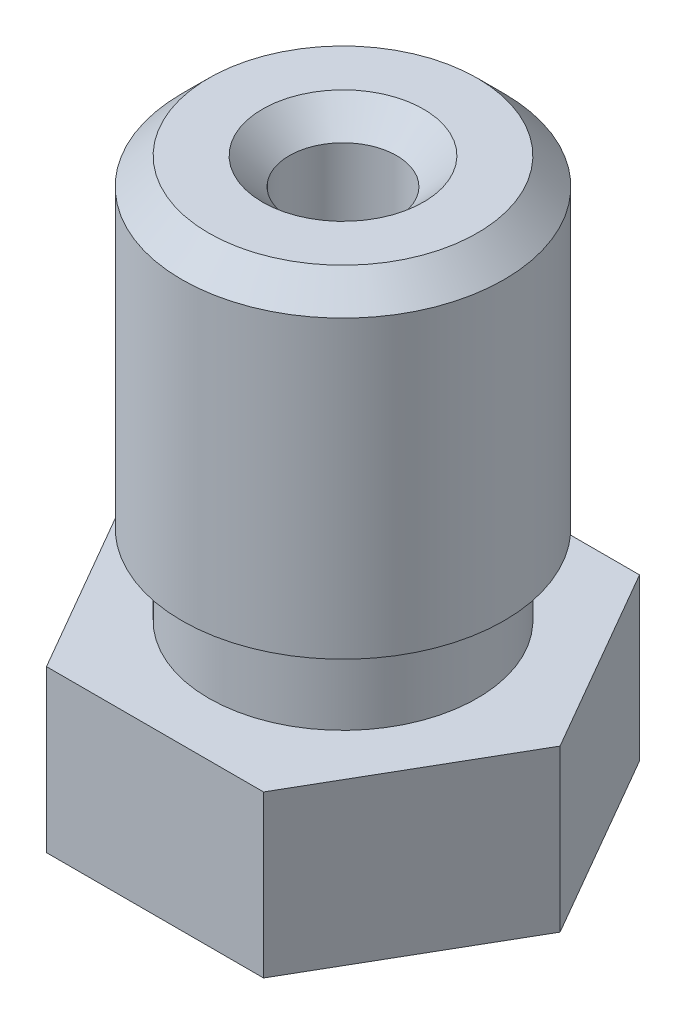
ISO-10303-21;
HEADER;
FILE_DESCRIPTION(('STEP AP214'),'2;1');
FILE_NAME('part.step','',(''),(''),'','','');
FILE_SCHEMA(('AUTOMOTIVE_DESIGN { 1 0 10303 214 1 1 1 1 }'));
ENDSEC;
DATA;
#1=APPLICATION_CONTEXT('core data for automotive mechanical design processes');
#2=APPLICATION_PROTOCOL_DEFINITION('international standard','automotive_design',2000,#1);
#3=PRODUCT_CONTEXT('',#1,'mechanical');
#4=PRODUCT('Part','Part','',(#3));
#5=PRODUCT_RELATED_PRODUCT_CATEGORY('part','',(#4));
#6=PRODUCT_DEFINITION_FORMATION('','',#4);
#7=PRODUCT_DEFINITION_CONTEXT('part definition',#1,'design');
#8=PRODUCT_DEFINITION('design','',#6,#7);
#9=PRODUCT_DEFINITION_SHAPE('','',#8);
#10=(LENGTH_UNIT() NAMED_UNIT(*) SI_UNIT(.MILLI.,.METRE.));
#11=(NAMED_UNIT(*) PLANE_ANGLE_UNIT() SI_UNIT($,.RADIAN.));
#12=(NAMED_UNIT(*) SI_UNIT($,.STERADIAN.) SOLID_ANGLE_UNIT());
#13=UNCERTAINTY_MEASURE_WITH_UNIT(LENGTH_MEASURE(1.E-05),#10,'distance_accuracy_value','');
#14=(GEOMETRIC_REPRESENTATION_CONTEXT(3) GLOBAL_UNCERTAINTY_ASSIGNED_CONTEXT((#13)) GLOBAL_UNIT_ASSIGNED_CONTEXT((#10,
#11,#12)) REPRESENTATION_CONTEXT('',''));
#15=CARTESIAN_POINT('',(0.,0.,0.));
#16=DIRECTION('',(0.,0.,1.));
#17=DIRECTION('',(1.,0.,0.));
#18=AXIS2_PLACEMENT_3D('',#15,#16,#17);
#19=CARTESIAN_POINT('',(2.02072594216369,3.,3.5));
#20=DIRECTION('',(0.,0.,1.));
#21=DIRECTION('',(1.,0.,0.));
#22=AXIS2_PLACEMENT_3D('',#19,#20,#21);
#23=PLANE('',#22);
#24=DIRECTION('',(-1.,0.,0.));
#25=VECTOR('',#24,1.);
#26=CARTESIAN_POINT('',(2.02072594216369,0.,3.5));
#27=LINE('',#26,#25);
#28=CARTESIAN_POINT('',(2.02072594216369,0.,3.5));
#29=VERTEX_POINT('',#28);
#30=CARTESIAN_POINT('',(-2.02072594216369,0.,3.5));
#31=VERTEX_POINT('',#30);
#32=EDGE_CURVE('E121',#29,#31,#27,.T.);
#33=ORIENTED_EDGE('',*,*,#32,.F.);
#34=DIRECTION('',(0.,-1.,0.));
#35=VECTOR('',#34,1.);
#36=CARTESIAN_POINT('',(2.02072594216369,3.,3.5));
#37=LINE('',#36,#35);
#38=CARTESIAN_POINT('',(2.02072594216369,3.,3.5));
#39=VERTEX_POINT('',#38);
#40=EDGE_CURVE('E50',#39,#29,#37,.T.);
#41=ORIENTED_EDGE('',*,*,#40,.F.);
#42=DIRECTION('',(-1.,0.,0.));
#43=VECTOR('',#42,1.);
#44=CARTESIAN_POINT('',(2.02072594216369,3.,3.5));
#45=LINE('',#44,#43);
#46=CARTESIAN_POINT('',(-2.02072594216369,3.,3.5));
#47=VERTEX_POINT('',#46);
#48=EDGE_CURVE('E137',#39,#47,#45,.T.);
#49=ORIENTED_EDGE('',*,*,#48,.T.);
#50=DIRECTION('',(0.,-1.,0.));
#51=VECTOR('',#50,1.);
#52=CARTESIAN_POINT('',(-2.02072594216369,3.,3.5));
#53=LINE('',#52,#51);
#54=EDGE_CURVE('E85',#47,#31,#53,.T.);
#55=ORIENTED_EDGE('',*,*,#54,.T.);
#56=EDGE_LOOP('',(#33,#41,#49,#55));
#57=FACE_BOUND('',#56,.T.);
#58=ADVANCED_FACE('F33',(#57),#23,.T.);
#59=CARTESIAN_POINT('',(4.04145188432738,3.,0.));
#60=DIRECTION('',(0.866025403784439,0.,0.5));
#61=DIRECTION('',(0.5,0.,-0.866025403784439));
#62=AXIS2_PLACEMENT_3D('',#59,#60,#61);
#63=PLANE('',#62);
#64=DIRECTION('',(-0.5,0.,0.866025403784439));
#65=VECTOR('',#64,1.);
#66=CARTESIAN_POINT('',(4.04145188432738,0.,0.));
#67=LINE('',#66,#65);
#68=CARTESIAN_POINT('',(4.04145188432738,0.,0.));
#69=VERTEX_POINT('',#68);
#70=EDGE_CURVE('E134',#69,#29,#67,.T.);
#71=ORIENTED_EDGE('',*,*,#70,.F.);
#72=DIRECTION('',(0.,-1.,0.));
#73=VECTOR('',#72,1.);
#74=CARTESIAN_POINT('',(4.04145188432738,3.,0.));
#75=LINE('',#74,#73);
#76=CARTESIAN_POINT('',(4.04145188432738,3.,0.));
#77=VERTEX_POINT('',#76);
#78=EDGE_CURVE('E73',#77,#69,#75,.T.);
#79=ORIENTED_EDGE('',*,*,#78,.F.);
#80=DIRECTION('',(-0.5,0.,0.866025403784439));
#81=VECTOR('',#80,1.);
#82=CARTESIAN_POINT('',(4.04145188432738,3.,0.));
#83=LINE('',#82,#81);
#84=EDGE_CURVE('E111',#77,#39,#83,.T.);
#85=ORIENTED_EDGE('',*,*,#84,.T.);
#86=ORIENTED_EDGE('',*,*,#40,.T.);
#87=EDGE_LOOP('',(#71,#79,#85,#86));
#88=FACE_BOUND('',#87,.T.);
#89=ADVANCED_FACE('F210',(#88),#63,.T.);
#90=CARTESIAN_POINT('',(2.02072594216369,3.,-3.5));
#91=DIRECTION('',(0.866025403784438,0.,-0.500000000000001));
#92=DIRECTION('',(-0.500000000000001,0.,-0.866025403784438));
#93=AXIS2_PLACEMENT_3D('',#90,#91,#92);
#94=PLANE('',#93);
#95=DIRECTION('',(0.500000000000001,0.,0.866025403784438));
#96=VECTOR('',#95,1.);
#97=CARTESIAN_POINT('',(2.02072594216369,0.,-3.5));
#98=LINE('',#97,#96);
#99=CARTESIAN_POINT('',(2.02072594216369,0.,-3.5));
#100=VERTEX_POINT('',#99);
#101=EDGE_CURVE('E98',#100,#69,#98,.T.);
#102=ORIENTED_EDGE('',*,*,#101,.F.);
#103=DIRECTION('',(0.,-1.,0.));
#104=VECTOR('',#103,1.);
#105=CARTESIAN_POINT('',(2.02072594216369,3.,-3.5));
#106=LINE('',#105,#104);
#107=CARTESIAN_POINT('',(2.02072594216369,3.,-3.5));
#108=VERTEX_POINT('',#107);
#109=EDGE_CURVE('E93',#108,#100,#106,.T.);
#110=ORIENTED_EDGE('',*,*,#109,.F.);
#111=DIRECTION('',(0.500000000000001,0.,0.866025403784438));
#112=VECTOR('',#111,1.);
#113=CARTESIAN_POINT('',(2.02072594216369,3.,-3.5));
#114=LINE('',#113,#112);
#115=EDGE_CURVE('E96',#108,#77,#114,.T.);
#116=ORIENTED_EDGE('',*,*,#115,.T.);
#117=ORIENTED_EDGE('',*,*,#78,.T.);
#118=EDGE_LOOP('',(#102,#110,#116,#117));
#119=FACE_BOUND('',#118,.T.);
#120=ADVANCED_FACE('F95',(#119),#94,.T.);
#121=CARTESIAN_POINT('',(-2.02072594216369,3.,-3.5));
#122=DIRECTION('',(0.,0.,-1.));
#123=DIRECTION('',(-1.,0.,0.));
#124=AXIS2_PLACEMENT_3D('',#121,#122,#123);
#125=PLANE('',#124);
#126=DIRECTION('',(1.,0.,0.));
#127=VECTOR('',#126,1.);
#128=CARTESIAN_POINT('',(-2.02072594216369,0.,-3.5));
#129=LINE('',#128,#127);
#130=CARTESIAN_POINT('',(-2.02072594216369,0.,-3.5));
#131=VERTEX_POINT('',#130);
#132=EDGE_CURVE('E131',#131,#100,#129,.T.);
#133=ORIENTED_EDGE('',*,*,#132,.F.);
#134=DIRECTION('',(0.,-1.,0.));
#135=VECTOR('',#134,1.);
#136=CARTESIAN_POINT('',(-2.02072594216369,3.,-3.5));
#137=LINE('',#136,#135);
#138=CARTESIAN_POINT('',(-2.02072594216369,3.,-3.5));
#139=VERTEX_POINT('',#138);
#140=EDGE_CURVE('E103',#139,#131,#137,.T.);
#141=ORIENTED_EDGE('',*,*,#140,.F.);
#142=DIRECTION('',(1.,0.,0.));
#143=VECTOR('',#142,1.);
#144=CARTESIAN_POINT('',(-2.02072594216369,3.,-3.5));
#145=LINE('',#144,#143);
#146=EDGE_CURVE('E109',#139,#108,#145,.T.);
#147=ORIENTED_EDGE('',*,*,#146,.T.);
#148=ORIENTED_EDGE('',*,*,#109,.T.);
#149=EDGE_LOOP('',(#133,#141,#147,#148));
#150=FACE_BOUND('',#149,.T.);
#151=ADVANCED_FACE('F113',(#150),#125,.T.);
#152=CARTESIAN_POINT('',(-4.04145188432738,3.,0.));
#153=DIRECTION('',(-0.866025403784439,0.,-0.5));
#154=DIRECTION('',(-0.5,0.,0.866025403784439));
#155=AXIS2_PLACEMENT_3D('',#152,#153,#154);
#156=PLANE('',#155);
#157=DIRECTION('',(0.5,0.,-0.866025403784439));
#158=VECTOR('',#157,1.);
#159=CARTESIAN_POINT('',(-4.04145188432738,0.,0.));
#160=LINE('',#159,#158);
#161=CARTESIAN_POINT('',(-4.04145188432738,0.,0.));
#162=VERTEX_POINT('',#161);
#163=EDGE_CURVE('E128',#162,#131,#160,.T.);
#164=ORIENTED_EDGE('',*,*,#163,.F.);
#165=DIRECTION('',(0.,-1.,0.));
#166=VECTOR('',#165,1.);
#167=CARTESIAN_POINT('',(-4.04145188432738,3.,0.));
#168=LINE('',#167,#166);
#169=CARTESIAN_POINT('',(-4.04145188432738,3.,0.));
#170=VERTEX_POINT('',#169);
#171=EDGE_CURVE('E142',#170,#162,#168,.T.);
#172=ORIENTED_EDGE('',*,*,#171,.F.);
#173=DIRECTION('',(0.5,0.,-0.866025403784439));
#174=VECTOR('',#173,1.);
#175=CARTESIAN_POINT('',(-4.04145188432738,3.,0.));
#176=LINE('',#175,#174);
#177=EDGE_CURVE('E114',#170,#139,#176,.T.);
#178=ORIENTED_EDGE('',*,*,#177,.T.);
#179=ORIENTED_EDGE('',*,*,#140,.T.);
#180=EDGE_LOOP('',(#164,#172,#178,#179));
#181=FACE_BOUND('',#180,.T.);
#182=ADVANCED_FACE('F224',(#181),#156,.T.);
#183=CARTESIAN_POINT('',(-2.02072594216369,3.,3.5));
#184=DIRECTION('',(-0.866025403784439,0.,0.5));
#185=DIRECTION('',(0.5,0.,0.866025403784439));
#186=AXIS2_PLACEMENT_3D('',#183,#184,#185);
#187=PLANE('',#186);
#188=DIRECTION('',(-0.5,0.,-0.866025403784439));
#189=VECTOR('',#188,1.);
#190=CARTESIAN_POINT('',(-2.02072594216369,0.,3.5));
#191=LINE('',#190,#189);
#192=EDGE_CURVE('E124',#31,#162,#191,.T.);
#193=ORIENTED_EDGE('',*,*,#192,.F.);
#194=ORIENTED_EDGE('',*,*,#54,.F.);
#195=DIRECTION('',(-0.5,0.,-0.866025403784439));
#196=VECTOR('',#195,1.);
#197=CARTESIAN_POINT('',(-2.02072594216369,3.,3.5));
#198=LINE('',#197,#196);
#199=EDGE_CURVE('E116',#47,#170,#198,.T.);
#200=ORIENTED_EDGE('',*,*,#199,.T.);
#201=ORIENTED_EDGE('',*,*,#171,.T.);
#202=EDGE_LOOP('',(#193,#194,#200,#201));
#203=FACE_BOUND('',#202,.T.);
#204=ADVANCED_FACE('F206',(#203),#187,.T.);
#205=CARTESIAN_POINT('',(0.,3.,0.));
#206=DIRECTION('',(0.,-1.,0.));
#207=DIRECTION('',(0.,0.,-1.));
#208=AXIS2_PLACEMENT_3D('',#205,#206,#207);
#209=PLANE('',#208);
#210=CARTESIAN_POINT('',(0.,3.,0.));
#211=DIRECTION('',(0.,1.,0.));
#212=DIRECTION('',(0.,0.,1.));
#213=AXIS2_PLACEMENT_3D('',#210,#211,#212);
#214=CIRCLE('',#213,2.5);
#215=CARTESIAN_POINT('',(0.,3.,2.5));
#216=VERTEX_POINT('',#215);
#217=EDGE_CURVE('E125',#216,#216,#214,.T.);
#218=ORIENTED_EDGE('',*,*,#217,.F.);
#219=EDGE_LOOP('',(#218));
#220=FACE_BOUND('',#219,.T.);
#221=ORIENTED_EDGE('',*,*,#48,.F.);
#222=ORIENTED_EDGE('',*,*,#84,.F.);
#223=ORIENTED_EDGE('',*,*,#115,.F.);
#224=ORIENTED_EDGE('',*,*,#146,.F.);
#225=ORIENTED_EDGE('',*,*,#177,.F.);
#226=ORIENTED_EDGE('',*,*,#199,.F.);
#227=EDGE_LOOP('',(#221,#222,#223,#224,#225,#226));
#228=FACE_BOUND('',#227,.T.);
#229=ADVANCED_FACE('F107',(#220,#228),#209,.F.);
#230=CARTESIAN_POINT('',(0.,0.,0.));
#231=DIRECTION('',(0.,-1.,0.));
#232=DIRECTION('',(0.,0.,-1.));
#233=AXIS2_PLACEMENT_3D('',#230,#231,#232);
#234=PLANE('',#233);
#235=CARTESIAN_POINT('',(0.,0.,0.));
#236=DIRECTION('',(0.,-1.,0.));
#237=DIRECTION('',(0.,0.,-1.));
#238=AXIS2_PLACEMENT_3D('',#235,#236,#237);
#239=CIRCLE('',#238,2.50000000004502);
#240=CARTESIAN_POINT('',(0.,0.,-2.50000000004502));
#241=VERTEX_POINT('',#240);
#242=EDGE_CURVE('E139',#241,#241,#239,.T.);
#243=ORIENTED_EDGE('',*,*,#242,.F.);
#244=EDGE_LOOP('',(#243));
#245=FACE_BOUND('',#244,.T.);
#246=ORIENTED_EDGE('',*,*,#32,.T.);
#247=ORIENTED_EDGE('',*,*,#192,.T.);
#248=ORIENTED_EDGE('',*,*,#163,.T.);
#249=ORIENTED_EDGE('',*,*,#132,.T.);
#250=ORIENTED_EDGE('',*,*,#101,.T.);
#251=ORIENTED_EDGE('',*,*,#70,.T.);
#252=EDGE_LOOP('',(#246,#247,#248,#249,#250,#251));
#253=FACE_BOUND('',#252,.T.);
#254=ADVANCED_FACE('F209',(#245,#253),#234,.T.);
#255=CARTESIAN_POINT('',(0.,3.,0.));
#256=DIRECTION('',(0.,1.,0.));
#257=DIRECTION('',(0.,0.,1.));
#258=AXIS2_PLACEMENT_3D('',#255,#256,#257);
#259=CYLINDRICAL_SURFACE('',#258,2.5);
#260=ORIENTED_EDGE('',*,*,#217,.T.);
#261=EDGE_LOOP('',(#260));
#262=FACE_BOUND('',#261,.T.);
#263=CARTESIAN_POINT('',(0.,4.5,0.));
#264=DIRECTION('',(0.,1.,0.));
#265=DIRECTION('',(0.,0.,1.));
#266=AXIS2_PLACEMENT_3D('',#263,#264,#265);
#267=CIRCLE('',#266,2.5);
#268=CARTESIAN_POINT('',(0.,4.5,2.5));
#269=VERTEX_POINT('',#268);
#270=EDGE_CURVE('E198',#269,#269,#267,.T.);
#271=ORIENTED_EDGE('',*,*,#270,.F.);
#272=EDGE_LOOP('',(#271));
#273=FACE_BOUND('',#272,.T.);
#274=ADVANCED_FACE('F167',(#262,#273),#259,.T.);
#275=CARTESIAN_POINT('',(0.,10.5,0.));
#276=DIRECTION('',(0.,1.,0.));
#277=DIRECTION('',(0.,0.,1.));
#278=AXIS2_PLACEMENT_3D('',#275,#276,#277);
#279=PLANE('',#278);
#280=CARTESIAN_POINT('',(0.,10.5,0.));
#281=DIRECTION('',(0.,1.,0.));
#282=DIRECTION('',(0.,0.,1.));
#283=AXIS2_PLACEMENT_3D('',#280,#281,#282);
#284=CIRCLE('',#283,2.4999999999834);
#285=CARTESIAN_POINT('',(0.,10.5,2.4999999999834));
#286=VERTEX_POINT('',#285);
#287=EDGE_CURVE('E150',#286,#286,#284,.T.);
#288=ORIENTED_EDGE('',*,*,#287,.T.);
#289=EDGE_LOOP('',(#288));
#290=FACE_BOUND('',#289,.T.);
#291=CARTESIAN_POINT('',(-1.10963134903613E-11,10.5,0.));
#292=DIRECTION('',(0.,1.,0.));
#293=DIRECTION('',(0.,0.,1.));
#294=AXIS2_PLACEMENT_3D('',#291,#292,#293);
#295=CIRCLE('',#294,1.5000000000277);
#296=CARTESIAN_POINT('',(-1.10963134903613E-11,10.5,1.5000000000277));
#297=VERTEX_POINT('',#296);
#298=EDGE_CURVE('E147',#297,#297,#295,.F.);
#299=ORIENTED_EDGE('',*,*,#298,.T.);
#300=EDGE_LOOP('',(#299));
#301=FACE_BOUND('',#300,.T.);
#302=ADVANCED_FACE('F164',(#290,#301),#279,.T.);
#303=CARTESIAN_POINT('',(0.,3.,0.));
#304=DIRECTION('',(0.,1.,0.));
#305=DIRECTION('',(0.,0.,1.));
#306=AXIS2_PLACEMENT_3D('',#303,#304,#305);
#307=CYLINDRICAL_SURFACE('',#306,3.);
#308=CARTESIAN_POINT('',(0.,9.9999999999834,0.));
#309=DIRECTION('',(0.,1.,0.));
#310=DIRECTION('',(0.,0.,1.));
#311=AXIS2_PLACEMENT_3D('',#308,#309,#310);
#312=CIRCLE('',#311,3.);
#313=CARTESIAN_POINT('',(0.,9.9999999999834,3.));
#314=VERTEX_POINT('',#313);
#315=EDGE_CURVE('E42',#314,#314,#312,.F.);
#316=ORIENTED_EDGE('',*,*,#315,.T.);
#317=EDGE_LOOP('',(#316));
#318=FACE_BOUND('',#317,.T.);
#319=CARTESIAN_POINT('',(0.,4.5,0.));
#320=DIRECTION('',(0.,1.,0.));
#321=DIRECTION('',(0.,0.,1.));
#322=AXIS2_PLACEMENT_3D('',#319,#320,#321);
#323=CIRCLE('',#322,3.);
#324=CARTESIAN_POINT('',(0.,4.5,3.));
#325=VERTEX_POINT('',#324);
#326=EDGE_CURVE('E201',#325,#325,#323,.T.);
#327=ORIENTED_EDGE('',*,*,#326,.T.);
#328=EDGE_LOOP('',(#327));
#329=FACE_BOUND('',#328,.T.);
#330=ADVANCED_FACE('F155',(#318,#329),#307,.T.);
#331=CARTESIAN_POINT('',(3.,4.5,0.));
#332=DIRECTION('',(0.,-1.,0.));
#333=DIRECTION('',(0.,0.,-1.));
#334=AXIS2_PLACEMENT_3D('',#331,#332,#333);
#335=PLANE('',#334);
#336=ORIENTED_EDGE('',*,*,#270,.T.);
#337=EDGE_LOOP('',(#336));
#338=FACE_BOUND('',#337,.T.);
#339=ORIENTED_EDGE('',*,*,#326,.F.);
#340=EDGE_LOOP('',(#339));
#341=FACE_BOUND('',#340,.T.);
#342=ADVANCED_FACE('F244',(#338,#341),#335,.T.);
#343=CARTESIAN_POINT('',(0.,-2.,0.));
#344=DIRECTION('',(0.,1.,0.));
#345=DIRECTION('',(-1.,0.,0.));
#346=AXIS2_PLACEMENT_3D('',#343,#344,#345);
#347=CONICAL_SURFACE('',#346,0.50000000004502,0.785398163397449);
#348=ORIENTED_EDGE('',*,*,#242,.T.);
#349=EDGE_LOOP('',(#348));
#350=FACE_BOUND('',#349,.T.);
#351=CARTESIAN_POINT('',(0.,-2.,0.));
#352=DIRECTION('',(0.,-1.,0.));
#353=DIRECTION('',(1.,0.,0.));
#354=AXIS2_PLACEMENT_3D('',#351,#352,#353);
#355=CIRCLE('',#354,0.50000000004502);
#356=CARTESIAN_POINT('',(0.50000000004502,-2.,0.));
#357=VERTEX_POINT('',#356);
#358=EDGE_CURVE('E189',#357,#357,#355,.T.);
#359=ORIENTED_EDGE('',*,*,#358,.F.);
#360=EDGE_LOOP('',(#359));
#361=FACE_BOUND('',#360,.T.);
#362=ADVANCED_FACE('F247',(#350,#361),#347,.T.);
#363=CARTESIAN_POINT('',(0.,-2.,0.));
#364=DIRECTION('',(0.,-1.,0.));
#365=DIRECTION('',(1.,0.,0.));
#366=AXIS2_PLACEMENT_3D('',#363,#364,#365);
#367=PLANE('',#366);
#368=CARTESIAN_POINT('',(-1.10963134903613E-11,-2.,0.));
#369=DIRECTION('',(0.,1.,0.));
#370=DIRECTION('',(0.,0.,1.));
#371=AXIS2_PLACEMENT_3D('',#368,#369,#370);
#372=CIRCLE('',#371,0.0999999999999996);
#373=CARTESIAN_POINT('',(-1.10963134903613E-11,-2.,0.0999999999999996));
#374=VERTEX_POINT('',#373);
#375=EDGE_CURVE('E185',#374,#374,#372,.T.);
#376=ORIENTED_EDGE('',*,*,#375,.T.);
#377=EDGE_LOOP('',(#376));
#378=FACE_BOUND('',#377,.T.);
#379=ORIENTED_EDGE('',*,*,#358,.T.);
#380=EDGE_LOOP('',(#379));
#381=FACE_BOUND('',#380,.T.);
#382=ADVANCED_FACE('F251',(#378,#381),#367,.T.);
#383=CARTESIAN_POINT('',(-1.10963134903613E-11,-2.,0.));
#384=DIRECTION('',(0.,1.,0.));
#385=DIRECTION('',(0.,0.,1.));
#386=AXIS2_PLACEMENT_3D('',#383,#384,#385);
#387=CYLINDRICAL_SURFACE('',#386,0.0999999999999997);
#388=ORIENTED_EDGE('',*,*,#375,.F.);
#389=EDGE_LOOP('',(#388));
#390=FACE_BOUND('',#389,.T.);
#391=CARTESIAN_POINT('',(-1.10963134903613E-11,-1.20000000003984,0.));
#392=DIRECTION('',(0.,1.,0.));
#393=DIRECTION('',(0.,0.,1.));
#394=AXIS2_PLACEMENT_3D('',#391,#392,#393);
#395=CIRCLE('',#394,0.0999999999999997);
#396=CARTESIAN_POINT('',(-1.10963134903613E-11,-1.20000000003984,0.0999999999999997));
#397=VERTEX_POINT('',#396);
#398=EDGE_CURVE('E273',#397,#397,#395,.T.);
#399=ORIENTED_EDGE('',*,*,#398,.T.);
#400=EDGE_LOOP('',(#399));
#401=FACE_BOUND('',#400,.T.);
#402=ADVANCED_FACE('F179',(#390,#401),#387,.F.);
#403=CARTESIAN_POINT('',(-1.10963134903613E-11,-2.,0.));
#404=DIRECTION('',(0.,1.,0.));
#405=DIRECTION('',(0.,0.,1.));
#406=AXIS2_PLACEMENT_3D('',#403,#404,#405);
#407=CYLINDRICAL_SURFACE('',#406,1.0000000000111);
#408=CARTESIAN_POINT('',(-1.10963134903613E-11,9.9999999999834,0.));
#409=DIRECTION('',(0.,1.,0.));
#410=DIRECTION('',(0.,0.,1.));
#411=AXIS2_PLACEMENT_3D('',#408,#409,#410);
#412=CIRCLE('',#411,1.0000000000111);
#413=CARTESIAN_POINT('',(-1.10963134903613E-11,9.9999999999834,1.0000000000111));
#414=VERTEX_POINT('',#413);
#415=EDGE_CURVE('E11',#414,#414,#412,.T.);
#416=ORIENTED_EDGE('',*,*,#415,.T.);
#417=EDGE_LOOP('',(#416));
#418=FACE_BOUND('',#417,.T.);
#419=CARTESIAN_POINT('',(-1.10963134903613E-11,0.,0.));
#420=DIRECTION('',(0.,1.,0.));
#421=DIRECTION('',(0.,0.,1.));
#422=AXIS2_PLACEMENT_3D('',#419,#420,#421);
#423=CIRCLE('',#422,1.0000000000111);
#424=CARTESIAN_POINT('',(-1.10963134903613E-11,0.,1.0000000000111));
#425=VERTEX_POINT('',#424);
#426=EDGE_CURVE('E183',#425,#425,#423,.T.);
#427=ORIENTED_EDGE('',*,*,#426,.F.);
#428=EDGE_LOOP('',(#427));
#429=FACE_BOUND('',#428,.T.);
#430=ADVANCED_FACE('F175',(#418,#429),#407,.F.);
#431=CARTESIAN_POINT('',(-1.10963134903613E-11,0.,0.));
#432=DIRECTION('',(0.,1.,0.));
#433=DIRECTION('',(0.,0.,1.));
#434=AXIS2_PLACEMENT_3D('',#431,#432,#433);
#435=CONICAL_SURFACE('',#434,1.0000000000111,0.832981266710198);
#436=CARTESIAN_POINT('',(-1.10963134903613E-11,-0.227272727272521,0.));
#437=DIRECTION('',(0.,1.,0.));
#438=DIRECTION('',(0.,0.,1.));
#439=AXIS2_PLACEMENT_3D('',#436,#437,#438);
#440=CIRCLE('',#439,0.749999999993361);
#441=CARTESIAN_POINT('',(-1.10963134903613E-11,-0.227272727272521,0.749999999993361));
#442=VERTEX_POINT('',#441);
#443=EDGE_CURVE('E186',#442,#442,#440,.T.);
#444=ORIENTED_EDGE('',*,*,#443,.F.);
#445=EDGE_LOOP('',(#444));
#446=FACE_BOUND('',#445,.T.);
#447=ORIENTED_EDGE('',*,*,#426,.T.);
#448=EDGE_LOOP('',(#447));
#449=FACE_BOUND('',#448,.T.);
#450=ADVANCED_FACE('F178',(#446,#449),#435,.F.);
#451=CARTESIAN_POINT('',(-1.10963134903613E-11,-2.,0.));
#452=DIRECTION('',(0.,1.,0.));
#453=DIRECTION('',(0.,0.,1.));
#454=AXIS2_PLACEMENT_3D('',#451,#452,#453);
#455=CYLINDRICAL_SURFACE('',#454,0.749999999993361);
#456=CARTESIAN_POINT('',(-1.10963134903613E-11,-0.700000000000002,0.));
#457=DIRECTION('',(0.,1.,0.));
#458=DIRECTION('',(0.,0.,1.));
#459=AXIS2_PLACEMENT_3D('',#456,#457,#458);
#460=CIRCLE('',#459,0.749999999993361);
#461=CARTESIAN_POINT('',(-1.10963134903613E-11,-0.700000000000002,0.749999999993361));
#462=VERTEX_POINT('',#461);
#463=EDGE_CURVE('E192',#462,#462,#460,.T.);
#464=ORIENTED_EDGE('',*,*,#463,.F.);
#465=EDGE_LOOP('',(#464));
#466=FACE_BOUND('',#465,.T.);
#467=ORIENTED_EDGE('',*,*,#443,.T.);
#468=EDGE_LOOP('',(#467));
#469=FACE_BOUND('',#468,.T.);
#470=ADVANCED_FACE('F261',(#466,#469),#455,.F.);
#471=CARTESIAN_POINT('',(-1.10963134903613E-11,-0.700000000000002,0.));
#472=DIRECTION('',(0.,1.,0.));
#473=DIRECTION('',(0.,0.,1.));
#474=AXIS2_PLACEMENT_3D('',#471,#472,#473);
#475=CONICAL_SURFACE('',#474,0.749999999993361,0.915100700509923);
#476=ORIENTED_EDGE('',*,*,#398,.F.);
#477=EDGE_LOOP('',(#476));
#478=FACE_BOUND('',#477,.T.);
#479=ORIENTED_EDGE('',*,*,#463,.T.);
#480=EDGE_LOOP('',(#479));
#481=FACE_BOUND('',#480,.T.);
#482=ADVANCED_FACE('F161',(#478,#481),#475,.F.);
#483=CARTESIAN_POINT('',(0.,10.5,0.));
#484=DIRECTION('',(0.,-1.,0.));
#485=DIRECTION('',(0.,0.,-1.));
#486=AXIS2_PLACEMENT_3D('',#483,#484,#485);
#487=CONICAL_SURFACE('',#486,2.4999999999834,0.785398163397446);
#488=ORIENTED_EDGE('',*,*,#315,.F.);
#489=EDGE_LOOP('',(#488));
#490=FACE_BOUND('',#489,.T.);
#491=ORIENTED_EDGE('',*,*,#287,.F.);
#492=EDGE_LOOP('',(#491));
#493=FACE_BOUND('',#492,.T.);
#494=ADVANCED_FACE('F158',(#490,#493),#487,.T.);
#495=CARTESIAN_POINT('',(-1.10963134903613E-11,9.9999999999834,0.));
#496=DIRECTION('',(0.,1.,0.));
#497=DIRECTION('',(0.,0.,1.));
#498=AXIS2_PLACEMENT_3D('',#495,#496,#497);
#499=CONICAL_SURFACE('',#498,1.0000000000111,0.785398163397452);
#500=ORIENTED_EDGE('',*,*,#298,.F.);
#501=EDGE_LOOP('',(#500));
#502=FACE_BOUND('',#501,.T.);
#503=ORIENTED_EDGE('',*,*,#415,.F.);
#504=EDGE_LOOP('',(#503));
#505=FACE_BOUND('',#504,.T.);
#506=ADVANCED_FACE('F35',(#502,#505),#499,.F.);
#507=CLOSED_SHELL('',(#58,#89,#120,#151,#182,#204,#229,#254,#274,#302,#330,#342,#362,#382,#402,
#430,#450,#470,#482,#494,#506));
#508=MANIFOLD_SOLID_BREP('B2',#507);
#509=ADVANCED_BREP_SHAPE_REPRESENTATION('',(#18,#508),#14);
#510=SHAPE_DEFINITION_REPRESENTATION(#9,#509);
ENDSEC;
END-ISO-10303-21;
